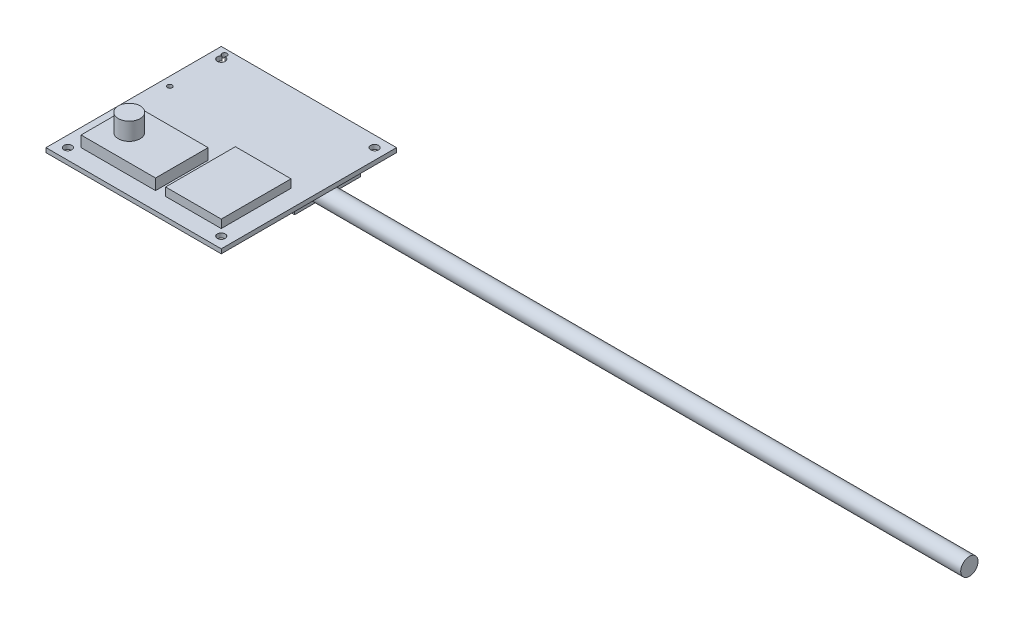
ISO-10303-21;
HEADER;
FILE_DESCRIPTION(('STEP AP214'),'2;1');
FILE_NAME('part.step','',(''),(''),'','','');
FILE_SCHEMA(('AUTOMOTIVE_DESIGN { 1 0 10303 214 1 1 1 1 }'));
ENDSEC;
DATA;
#1=APPLICATION_CONTEXT('core data for automotive mechanical design processes');
#2=APPLICATION_PROTOCOL_DEFINITION('international standard','automotive_design',2000,#1);
#3=PRODUCT_CONTEXT('',#1,'mechanical');
#4=PRODUCT('Part','Part','',(#3));
#5=PRODUCT_RELATED_PRODUCT_CATEGORY('part','',(#4));
#6=PRODUCT_DEFINITION_FORMATION('','',#4);
#7=PRODUCT_DEFINITION_CONTEXT('part definition',#1,'design');
#8=PRODUCT_DEFINITION('design','',#6,#7);
#9=PRODUCT_DEFINITION_SHAPE('','',#8);
#10=(LENGTH_UNIT() NAMED_UNIT(*) SI_UNIT(.MILLI.,.METRE.));
#11=(NAMED_UNIT(*) PLANE_ANGLE_UNIT() SI_UNIT($,.RADIAN.));
#12=(NAMED_UNIT(*) SI_UNIT($,.STERADIAN.) SOLID_ANGLE_UNIT());
#13=UNCERTAINTY_MEASURE_WITH_UNIT(LENGTH_MEASURE(1.E-05),#10,'distance_accuracy_value','');
#14=(GEOMETRIC_REPRESENTATION_CONTEXT(3) GLOBAL_UNCERTAINTY_ASSIGNED_CONTEXT((#13)) GLOBAL_UNIT_ASSIGNED_CONTEXT((#10,
#11,#12)) REPRESENTATION_CONTEXT('',''));
#15=CARTESIAN_POINT('',(0.,0.,0.));
#16=DIRECTION('',(0.,0.,1.));
#17=DIRECTION('',(1.,0.,0.));
#18=AXIS2_PLACEMENT_3D('',#15,#16,#17);
#19=CARTESIAN_POINT('',(0.,2.,0.));
#20=DIRECTION('',(0.,-1.,0.));
#21=DIRECTION('',(0.,0.,-1.));
#22=AXIS2_PLACEMENT_3D('',#19,#20,#21);
#23=PLANE('',#22);
#24=DIRECTION('',(0.,0.,1.));
#25=VECTOR('',#24,1.);
#26=CARTESIAN_POINT('',(7.99999999999999,2.,-32.));
#27=LINE('',#26,#25);
#28=CARTESIAN_POINT('',(7.99999999999999,2.,-32.));
#29=VERTEX_POINT('',#28);
#30=CARTESIAN_POINT('',(8.,2.,-8.));
#31=VERTEX_POINT('',#30);
#32=EDGE_CURVE('E189',#29,#31,#27,.T.);
#33=ORIENTED_EDGE('',*,*,#32,.F.);
#34=DIRECTION('',(-1.,0.,0.));
#35=VECTOR('',#34,1.);
#36=CARTESIAN_POINT('',(7.99999999999999,2.,-32.));
#37=LINE('',#36,#35);
#38=CARTESIAN_POINT('',(42.,2.,-32.));
#39=VERTEX_POINT('',#38);
#40=EDGE_CURVE('E195',#39,#29,#37,.T.);
#41=ORIENTED_EDGE('',*,*,#40,.F.);
#42=DIRECTION('',(0.,0.,-1.));
#43=VECTOR('',#42,1.);
#44=CARTESIAN_POINT('',(42.,2.,-32.));
#45=LINE('',#44,#43);
#46=CARTESIAN_POINT('',(42.,2.,-8.));
#47=VERTEX_POINT('',#46);
#48=EDGE_CURVE('E207',#47,#39,#45,.T.);
#49=ORIENTED_EDGE('',*,*,#48,.F.);
#50=DIRECTION('',(1.,0.,0.));
#51=VECTOR('',#50,1.);
#52=CARTESIAN_POINT('',(8.,2.,-8.));
#53=LINE('',#52,#51);
#54=EDGE_CURVE('E204',#31,#47,#53,.T.);
#55=ORIENTED_EDGE('',*,*,#54,.F.);
#56=EDGE_LOOP('',(#33,#41,#49,#55));
#57=FACE_BOUND('',#56,.T.);
#58=CARTESIAN_POINT('',(4.00000000000001,2.,-52.5));
#59=DIRECTION('',(0.,-1.,0.));
#60=DIRECTION('',(0.,0.,-1.));
#61=AXIS2_PLACEMENT_3D('',#58,#59,#60);
#62=CIRCLE('',#61,1.115);
#63=CARTESIAN_POINT('',(4.00000000000001,2.,-53.615));
#64=VERTEX_POINT('',#63);
#65=EDGE_CURVE('E223',#64,#64,#62,.T.);
#66=ORIENTED_EDGE('',*,*,#65,.T.);
#67=EDGE_LOOP('',(#66));
#68=FACE_BOUND('',#67,.T.);
#69=CARTESIAN_POINT('',(75.,2.,-75.));
#70=DIRECTION('',(0.,1.,0.));
#71=DIRECTION('',(0.,0.,1.));
#72=AXIS2_PLACEMENT_3D('',#69,#70,#71);
#73=CIRCLE('',#72,1.8);
#74=CARTESIAN_POINT('',(75.,2.,-73.2));
#75=VERTEX_POINT('',#74);
#76=EDGE_CURVE('E267',#75,#75,#73,.T.);
#77=ORIENTED_EDGE('',*,*,#76,.F.);
#78=EDGE_LOOP('',(#77));
#79=FACE_BOUND('',#78,.T.);
#80=CARTESIAN_POINT('',(5.,2.,-75.));
#81=DIRECTION('',(0.,1.,0.));
#82=DIRECTION('',(0.,0.,1.));
#83=AXIS2_PLACEMENT_3D('',#80,#81,#82);
#84=CIRCLE('',#83,1.8);
#85=CARTESIAN_POINT('',(3.86089167085515,2.,-76.3937116683421));
#86=VERTEX_POINT('',#85);
#87=CARTESIAN_POINT('',(4.86369108776554,2.,-76.7948314351062));
#88=VERTEX_POINT('',#87);
#89=EDGE_CURVE('E270',#86,#88,#84,.T.);
#90=ORIENTED_EDGE('',*,*,#89,.F.);
#91=CARTESIAN_POINT('',(4.,2.,-77.5));
#92=DIRECTION('',(0.,-1.,0.));
#93=DIRECTION('',(0.,0.,-1.));
#94=AXIS2_PLACEMENT_3D('',#91,#92,#93);
#95=CIRCLE('',#94,1.115);
#96=EDGE_CURVE('E227',#86,#88,#95,.T.);
#97=ORIENTED_EDGE('',*,*,#96,.T.);
#98=EDGE_LOOP('',(#90,#97));
#99=FACE_BOUND('',#98,.T.);
#100=DIRECTION('',(0.,0.,1.));
#101=VECTOR('',#100,1.);
#102=CARTESIAN_POINT('',(0.,2.,0.));
#103=LINE('',#102,#101);
#104=CARTESIAN_POINT('',(0.,2.,-80.));
#105=VERTEX_POINT('',#104);
#106=CARTESIAN_POINT('',(0.,2.,0.));
#107=VERTEX_POINT('',#106);
#108=EDGE_CURVE('E277',#105,#107,#103,.T.);
#109=ORIENTED_EDGE('',*,*,#108,.T.);
#110=DIRECTION('',(1.,0.,0.));
#111=VECTOR('',#110,1.);
#112=CARTESIAN_POINT('',(0.,2.,0.));
#113=LINE('',#112,#111);
#114=CARTESIAN_POINT('',(80.,2.,0.));
#115=VERTEX_POINT('',#114);
#116=EDGE_CURVE('E280',#107,#115,#113,.T.);
#117=ORIENTED_EDGE('',*,*,#116,.T.);
#118=DIRECTION('',(0.,0.,-1.));
#119=VECTOR('',#118,1.);
#120=CARTESIAN_POINT('',(80.,2.,0.));
#121=LINE('',#120,#119);
#122=CARTESIAN_POINT('',(80.,2.,-80.));
#123=VERTEX_POINT('',#122);
#124=EDGE_CURVE('E283',#115,#123,#121,.T.);
#125=ORIENTED_EDGE('',*,*,#124,.T.);
#126=DIRECTION('',(-1.,0.,0.));
#127=VECTOR('',#126,1.);
#128=CARTESIAN_POINT('',(0.,2.,-80.));
#129=LINE('',#128,#127);
#130=EDGE_CURVE('E285',#123,#105,#129,.T.);
#131=ORIENTED_EDGE('',*,*,#130,.T.);
#132=EDGE_LOOP('',(#109,#117,#125,#131));
#133=FACE_BOUND('',#132,.T.);
#134=CARTESIAN_POINT('',(5.,2.,-4.99999999999999));
#135=DIRECTION('',(0.,1.,0.));
#136=DIRECTION('',(0.,0.,1.));
#137=AXIS2_PLACEMENT_3D('',#134,#135,#136);
#138=CIRCLE('',#137,1.8);
#139=CARTESIAN_POINT('',(5.,2.,-3.19999999999999));
#140=VERTEX_POINT('',#139);
#141=EDGE_CURVE('E309',#140,#140,#138,.T.);
#142=ORIENTED_EDGE('',*,*,#141,.F.);
#143=EDGE_LOOP('',(#142));
#144=FACE_BOUND('',#143,.T.);
#145=CARTESIAN_POINT('',(75.,2.,-4.99999999999999));
#146=DIRECTION('',(0.,1.,0.));
#147=DIRECTION('',(0.,0.,1.));
#148=AXIS2_PLACEMENT_3D('',#145,#146,#147);
#149=CIRCLE('',#148,1.8);
#150=CARTESIAN_POINT('',(75.,2.,-3.19999999999999));
#151=VERTEX_POINT('',#150);
#152=EDGE_CURVE('E315',#151,#151,#149,.T.);
#153=ORIENTED_EDGE('',*,*,#152,.F.);
#154=EDGE_LOOP('',(#153));
#155=FACE_BOUND('',#154,.T.);
#156=DIRECTION('',(0.,0.,1.));
#157=VECTOR('',#156,1.);
#158=CARTESIAN_POINT('',(46.6,2.,-39.85));
#159=LINE('',#158,#157);
#160=CARTESIAN_POINT('',(46.6,2.,-39.85));
#161=VERTEX_POINT('',#160);
#162=CARTESIAN_POINT('',(46.6,2.,-8.));
#163=VERTEX_POINT('',#162);
#164=EDGE_CURVE('E178',#161,#163,#159,.T.);
#165=ORIENTED_EDGE('',*,*,#164,.F.);
#166=DIRECTION('',(-1.,0.,0.));
#167=VECTOR('',#166,1.);
#168=CARTESIAN_POINT('',(46.6,2.,-39.85));
#169=LINE('',#168,#167);
#170=CARTESIAN_POINT('',(72.,2.,-39.85));
#171=VERTEX_POINT('',#170);
#172=EDGE_CURVE('E175',#171,#161,#169,.T.);
#173=ORIENTED_EDGE('',*,*,#172,.F.);
#174=DIRECTION('',(0.,0.,-1.));
#175=VECTOR('',#174,1.);
#176=CARTESIAN_POINT('',(72.,2.,-39.85));
#177=LINE('',#176,#175);
#178=CARTESIAN_POINT('',(72.,2.,-8.));
#179=VERTEX_POINT('',#178);
#180=EDGE_CURVE('E53',#179,#171,#177,.T.);
#181=ORIENTED_EDGE('',*,*,#180,.F.);
#182=DIRECTION('',(1.,0.,0.));
#183=VECTOR('',#182,1.);
#184=CARTESIAN_POINT('',(46.6,2.,-8.));
#185=LINE('',#184,#183);
#186=EDGE_CURVE('E48',#163,#179,#185,.T.);
#187=ORIENTED_EDGE('',*,*,#186,.F.);
#188=EDGE_LOOP('',(#165,#173,#181,#187));
#189=FACE_BOUND('',#188,.T.);
#190=ADVANCED_FACE('F33',(#57,#68,#79,#99,#133,#144,#155,#189),#23,.F.);
#191=CARTESIAN_POINT('',(0.,2.,0.));
#192=DIRECTION('',(1.,0.,0.));
#193=DIRECTION('',(0.,0.,-1.));
#194=AXIS2_PLACEMENT_3D('',#191,#192,#193);
#195=PLANE('',#194);
#196=DIRECTION('',(0.,0.,1.));
#197=VECTOR('',#196,1.);
#198=CARTESIAN_POINT('',(0.,0.,0.));
#199=LINE('',#198,#197);
#200=CARTESIAN_POINT('',(0.,0.,-80.));
#201=VERTEX_POINT('',#200);
#202=CARTESIAN_POINT('',(0.,0.,0.));
#203=VERTEX_POINT('',#202);
#204=EDGE_CURVE('E274',#201,#203,#199,.T.);
#205=ORIENTED_EDGE('',*,*,#204,.T.);
#206=DIRECTION('',(0.,-1.,0.));
#207=VECTOR('',#206,1.);
#208=CARTESIAN_POINT('',(0.,2.,0.));
#209=LINE('',#208,#207);
#210=EDGE_CURVE('E303',#107,#203,#209,.T.);
#211=ORIENTED_EDGE('',*,*,#210,.F.);
#212=ORIENTED_EDGE('',*,*,#108,.F.);
#213=DIRECTION('',(0.,-1.,0.));
#214=VECTOR('',#213,1.);
#215=CARTESIAN_POINT('',(0.,2.,-80.));
#216=LINE('',#215,#214);
#217=EDGE_CURVE('E287',#105,#201,#216,.T.);
#218=ORIENTED_EDGE('',*,*,#217,.T.);
#219=EDGE_LOOP('',(#205,#211,#212,#218));
#220=FACE_BOUND('',#219,.T.);
#221=ADVANCED_FACE('F355',(#220),#195,.F.);
#222=CARTESIAN_POINT('',(0.,2.,0.));
#223=DIRECTION('',(0.,0.,-1.));
#224=DIRECTION('',(-1.,0.,0.));
#225=AXIS2_PLACEMENT_3D('',#222,#223,#224);
#226=PLANE('',#225);
#227=DIRECTION('',(1.,0.,0.));
#228=VECTOR('',#227,1.);
#229=CARTESIAN_POINT('',(0.,0.,0.));
#230=LINE('',#229,#228);
#231=CARTESIAN_POINT('',(80.,0.,0.));
#232=VERTEX_POINT('',#231);
#233=EDGE_CURVE('E290',#203,#232,#230,.T.);
#234=ORIENTED_EDGE('',*,*,#233,.T.);
#235=DIRECTION('',(0.,-1.,0.));
#236=VECTOR('',#235,1.);
#237=CARTESIAN_POINT('',(80.,2.,0.));
#238=LINE('',#237,#236);
#239=EDGE_CURVE('E300',#115,#232,#238,.T.);
#240=ORIENTED_EDGE('',*,*,#239,.F.);
#241=ORIENTED_EDGE('',*,*,#116,.F.);
#242=ORIENTED_EDGE('',*,*,#210,.T.);
#243=EDGE_LOOP('',(#234,#240,#241,#242));
#244=FACE_BOUND('',#243,.T.);
#245=ADVANCED_FACE('F465',(#244),#226,.F.);
#246=CARTESIAN_POINT('',(80.,2.,0.));
#247=DIRECTION('',(-1.,0.,0.));
#248=DIRECTION('',(0.,0.,1.));
#249=AXIS2_PLACEMENT_3D('',#246,#247,#248);
#250=PLANE('',#249);
#251=DIRECTION('',(0.,0.,-1.));
#252=VECTOR('',#251,1.);
#253=CARTESIAN_POINT('',(80.,0.,0.));
#254=LINE('',#253,#252);
#255=CARTESIAN_POINT('',(80.,0.,-80.));
#256=VERTEX_POINT('',#255);
#257=EDGE_CURVE('E292',#232,#256,#254,.T.);
#258=ORIENTED_EDGE('',*,*,#257,.T.);
#259=DIRECTION('',(0.,-1.,0.));
#260=VECTOR('',#259,1.);
#261=CARTESIAN_POINT('',(80.,2.,-80.));
#262=LINE('',#261,#260);
#263=EDGE_CURVE('E297',#123,#256,#262,.T.);
#264=ORIENTED_EDGE('',*,*,#263,.F.);
#265=ORIENTED_EDGE('',*,*,#124,.F.);
#266=ORIENTED_EDGE('',*,*,#239,.T.);
#267=EDGE_LOOP('',(#258,#264,#265,#266));
#268=FACE_BOUND('',#267,.T.);
#269=ADVANCED_FACE('F461',(#268),#250,.F.);
#270=CARTESIAN_POINT('',(0.,2.,-80.));
#271=DIRECTION('',(0.,0.,1.));
#272=DIRECTION('',(1.,0.,0.));
#273=AXIS2_PLACEMENT_3D('',#270,#271,#272);
#274=PLANE('',#273);
#275=DIRECTION('',(-1.,0.,0.));
#276=VECTOR('',#275,1.);
#277=CARTESIAN_POINT('',(0.,0.,-80.));
#278=LINE('',#277,#276);
#279=EDGE_CURVE('E281',#256,#201,#278,.T.);
#280=ORIENTED_EDGE('',*,*,#279,.T.);
#281=ORIENTED_EDGE('',*,*,#217,.F.);
#282=ORIENTED_EDGE('',*,*,#130,.F.);
#283=ORIENTED_EDGE('',*,*,#263,.T.);
#284=EDGE_LOOP('',(#280,#281,#282,#283));
#285=FACE_BOUND('',#284,.T.);
#286=ADVANCED_FACE('F332',(#285),#274,.F.);
#287=CARTESIAN_POINT('',(0.,0.,0.));
#288=DIRECTION('',(0.,-1.,0.));
#289=DIRECTION('',(0.,0.,-1.));
#290=AXIS2_PLACEMENT_3D('',#287,#288,#289);
#291=PLANE('',#290);
#292=CARTESIAN_POINT('',(4.00000000000001,0.,-52.5));
#293=DIRECTION('',(0.,-1.,0.));
#294=DIRECTION('',(0.,0.,-1.));
#295=AXIS2_PLACEMENT_3D('',#292,#293,#294);
#296=CIRCLE('',#295,1.115);
#297=CARTESIAN_POINT('',(4.00000000000001,0.,-53.615));
#298=VERTEX_POINT('',#297);
#299=EDGE_CURVE('E226',#298,#298,#296,.T.);
#300=ORIENTED_EDGE('',*,*,#299,.F.);
#301=EDGE_LOOP('',(#300));
#302=FACE_BOUND('',#301,.T.);
#303=CARTESIAN_POINT('',(4.,0.,-77.5));
#304=DIRECTION('',(0.,-1.,0.));
#305=DIRECTION('',(0.,0.,-1.));
#306=AXIS2_PLACEMENT_3D('',#303,#304,#305);
#307=CIRCLE('',#306,1.115);
#308=CARTESIAN_POINT('',(3.86089167085515,0.,-76.3937116683421));
#309=VERTEX_POINT('',#308);
#310=CARTESIAN_POINT('',(4.86369108776555,0.,-76.7948314351062));
#311=VERTEX_POINT('',#310);
#312=EDGE_CURVE('E230',#309,#311,#307,.T.);
#313=ORIENTED_EDGE('',*,*,#312,.F.);
#314=CARTESIAN_POINT('',(5.,0.,-75.));
#315=DIRECTION('',(0.,1.,0.));
#316=DIRECTION('',(0.,0.,1.));
#317=AXIS2_PLACEMENT_3D('',#314,#315,#316);
#318=CIRCLE('',#317,1.8);
#319=EDGE_CURVE('E271',#309,#311,#318,.T.);
#320=ORIENTED_EDGE('',*,*,#319,.T.);
#321=EDGE_LOOP('',(#313,#320));
#322=FACE_BOUND('',#321,.T.);
#323=DIRECTION('',(0.,0.,1.));
#324=VECTOR('',#323,1.);
#325=CARTESIAN_POINT('',(11.5,0.,-75.));
#326=LINE('',#325,#324);
#327=CARTESIAN_POINT('',(11.5,0.,-75.));
#328=VERTEX_POINT('',#327);
#329=CARTESIAN_POINT('',(11.5,0.,-45.));
#330=VERTEX_POINT('',#329);
#331=EDGE_CURVE('E232',#328,#330,#326,.T.);
#332=ORIENTED_EDGE('',*,*,#331,.T.);
#333=DIRECTION('',(1.,0.,0.));
#334=VECTOR('',#333,1.);
#335=CARTESIAN_POINT('',(11.5,0.,-45.));
#336=LINE('',#335,#334);
#337=CARTESIAN_POINT('',(68.5,0.,-45.));
#338=VERTEX_POINT('',#337);
#339=EDGE_CURVE('E248',#330,#338,#336,.T.);
#340=ORIENTED_EDGE('',*,*,#339,.T.);
#341=DIRECTION('',(0.,0.,-1.));
#342=VECTOR('',#341,1.);
#343=CARTESIAN_POINT('',(68.5,0.,-75.));
#344=LINE('',#343,#342);
#345=CARTESIAN_POINT('',(68.5,0.,-75.));
#346=VERTEX_POINT('',#345);
#347=EDGE_CURVE('E250',#338,#346,#344,.T.);
#348=ORIENTED_EDGE('',*,*,#347,.T.);
#349=DIRECTION('',(-1.,0.,0.));
#350=VECTOR('',#349,1.);
#351=CARTESIAN_POINT('',(11.5,0.,-75.));
#352=LINE('',#351,#350);
#353=EDGE_CURVE('E237',#346,#328,#352,.T.);
#354=ORIENTED_EDGE('',*,*,#353,.T.);
#355=EDGE_LOOP('',(#332,#340,#348,#354));
#356=FACE_BOUND('',#355,.T.);
#357=CARTESIAN_POINT('',(75.,0.,-75.));
#358=DIRECTION('',(0.,1.,0.));
#359=DIRECTION('',(0.,0.,1.));
#360=AXIS2_PLACEMENT_3D('',#357,#358,#359);
#361=CIRCLE('',#360,1.8);
#362=CARTESIAN_POINT('',(75.,0.,-73.2));
#363=VERTEX_POINT('',#362);
#364=EDGE_CURVE('E256',#363,#363,#361,.T.);
#365=ORIENTED_EDGE('',*,*,#364,.T.);
#366=EDGE_LOOP('',(#365));
#367=FACE_BOUND('',#366,.T.);
#368=ORIENTED_EDGE('',*,*,#204,.F.);
#369=ORIENTED_EDGE('',*,*,#279,.F.);
#370=ORIENTED_EDGE('',*,*,#257,.F.);
#371=ORIENTED_EDGE('',*,*,#233,.F.);
#372=EDGE_LOOP('',(#368,#369,#370,#371));
#373=FACE_BOUND('',#372,.T.);
#374=CARTESIAN_POINT('',(5.,0.,-4.99999999999999));
#375=DIRECTION('',(0.,1.,0.));
#376=DIRECTION('',(0.,0.,1.));
#377=AXIS2_PLACEMENT_3D('',#374,#375,#376);
#378=CIRCLE('',#377,1.8);
#379=CARTESIAN_POINT('',(5.,0.,-3.19999999999999));
#380=VERTEX_POINT('',#379);
#381=EDGE_CURVE('E306',#380,#380,#378,.T.);
#382=ORIENTED_EDGE('',*,*,#381,.T.);
#383=EDGE_LOOP('',(#382));
#384=FACE_BOUND('',#383,.T.);
#385=CARTESIAN_POINT('',(75.,0.,-4.99999999999999));
#386=DIRECTION('',(0.,1.,0.));
#387=DIRECTION('',(0.,0.,1.));
#388=AXIS2_PLACEMENT_3D('',#385,#386,#387);
#389=CIRCLE('',#388,1.8);
#390=CARTESIAN_POINT('',(75.,0.,-3.19999999999999));
#391=VERTEX_POINT('',#390);
#392=EDGE_CURVE('E312',#391,#391,#389,.T.);
#393=ORIENTED_EDGE('',*,*,#392,.T.);
#394=EDGE_LOOP('',(#393));
#395=FACE_BOUND('',#394,.T.);
#396=ADVANCED_FACE('F328',(#302,#322,#356,#367,#373,#384,#395),#291,.T.);
#397=CARTESIAN_POINT('',(5.,0.,-75.));
#398=DIRECTION('',(0.,1.,0.));
#399=DIRECTION('',(0.,0.,1.));
#400=AXIS2_PLACEMENT_3D('',#397,#398,#399);
#401=CYLINDRICAL_SURFACE('',#400,1.8);
#402=ORIENTED_EDGE('',*,*,#319,.F.);
#403=DIRECTION('',(0.,-1.,0.));
#404=VECTOR('',#403,1.);
#405=CARTESIAN_POINT('',(3.86089167085515,-5.4,-76.3937116683421));
#406=LINE('',#405,#404);
#407=EDGE_CURVE('E41',#309,#86,#406,.F.);
#408=ORIENTED_EDGE('',*,*,#407,.T.);
#409=ORIENTED_EDGE('',*,*,#89,.T.);
#410=DIRECTION('',(0.,-1.,0.));
#411=VECTOR('',#410,1.);
#412=CARTESIAN_POINT('',(4.86369108776554,-5.4,-76.7948314351062));
#413=LINE('',#412,#411);
#414=EDGE_CURVE('E318',#88,#311,#413,.T.);
#415=ORIENTED_EDGE('',*,*,#414,.T.);
#416=EDGE_LOOP('',(#402,#408,#409,#415));
#417=FACE_BOUND('',#416,.T.);
#418=ADVANCED_FACE('F331',(#417),#401,.F.);
#419=CARTESIAN_POINT('',(75.,0.,-75.));
#420=DIRECTION('',(0.,1.,0.));
#421=DIRECTION('',(0.,0.,1.));
#422=AXIS2_PLACEMENT_3D('',#419,#420,#421);
#423=CYLINDRICAL_SURFACE('',#422,1.8);
#424=ORIENTED_EDGE('',*,*,#364,.F.);
#425=EDGE_LOOP('',(#424));
#426=FACE_BOUND('',#425,.T.);
#427=ORIENTED_EDGE('',*,*,#76,.T.);
#428=EDGE_LOOP('',(#427));
#429=FACE_BOUND('',#428,.T.);
#430=ADVANCED_FACE('F452',(#426,#429),#423,.F.);
#431=CARTESIAN_POINT('',(5.,0.,-4.99999999999999));
#432=DIRECTION('',(0.,1.,0.));
#433=DIRECTION('',(0.,0.,1.));
#434=AXIS2_PLACEMENT_3D('',#431,#432,#433);
#435=CYLINDRICAL_SURFACE('',#434,1.8);
#436=ORIENTED_EDGE('',*,*,#381,.F.);
#437=EDGE_LOOP('',(#436));
#438=FACE_BOUND('',#437,.T.);
#439=ORIENTED_EDGE('',*,*,#141,.T.);
#440=EDGE_LOOP('',(#439));
#441=FACE_BOUND('',#440,.T.);
#442=ADVANCED_FACE('F351',(#438,#441),#435,.F.);
#443=CARTESIAN_POINT('',(75.,0.,-4.99999999999999));
#444=DIRECTION('',(0.,1.,0.));
#445=DIRECTION('',(0.,0.,1.));
#446=AXIS2_PLACEMENT_3D('',#443,#444,#445);
#447=CYLINDRICAL_SURFACE('',#446,1.8);
#448=ORIENTED_EDGE('',*,*,#392,.F.);
#449=EDGE_LOOP('',(#448));
#450=FACE_BOUND('',#449,.T.);
#451=ORIENTED_EDGE('',*,*,#152,.T.);
#452=EDGE_LOOP('',(#451));
#453=FACE_BOUND('',#452,.T.);
#454=ADVANCED_FACE('F35',(#450,#453),#447,.F.);
#455=CARTESIAN_POINT('',(11.5,-12.8,-75.));
#456=DIRECTION('',(-1.,0.,0.));
#457=DIRECTION('',(0.,0.,1.));
#458=AXIS2_PLACEMENT_3D('',#455,#456,#457);
#459=PLANE('',#458);
#460=ORIENTED_EDGE('',*,*,#331,.F.);
#461=DIRECTION('',(0.,1.,0.));
#462=VECTOR('',#461,1.);
#463=CARTESIAN_POINT('',(11.5,-12.8,-75.));
#464=LINE('',#463,#462);
#465=CARTESIAN_POINT('',(11.5,-12.8,-75.));
#466=VERTEX_POINT('',#465);
#467=EDGE_CURVE('E253',#466,#328,#464,.T.);
#468=ORIENTED_EDGE('',*,*,#467,.F.);
#469=DIRECTION('',(0.,0.,1.));
#470=VECTOR('',#469,1.);
#471=CARTESIAN_POINT('',(11.5,-12.8,-75.));
#472=LINE('',#471,#470);
#473=CARTESIAN_POINT('',(11.5,-12.8,-45.));
#474=VERTEX_POINT('',#473);
#475=EDGE_CURVE('E233',#466,#474,#472,.T.);
#476=ORIENTED_EDGE('',*,*,#475,.T.);
#477=DIRECTION('',(0.,1.,0.));
#478=VECTOR('',#477,1.);
#479=CARTESIAN_POINT('',(11.5,-12.8,-45.));
#480=LINE('',#479,#478);
#481=EDGE_CURVE('E246',#474,#330,#480,.T.);
#482=ORIENTED_EDGE('',*,*,#481,.T.);
#483=EDGE_LOOP('',(#460,#468,#476,#482));
#484=FACE_BOUND('',#483,.T.);
#485=ADVANCED_FACE('F350',(#484),#459,.T.);
#486=CARTESIAN_POINT('',(11.5,-12.8,-75.));
#487=DIRECTION('',(0.,0.,-1.));
#488=DIRECTION('',(-1.,0.,0.));
#489=AXIS2_PLACEMENT_3D('',#486,#487,#488);
#490=PLANE('',#489);
#491=ORIENTED_EDGE('',*,*,#353,.F.);
#492=DIRECTION('',(0.,1.,0.));
#493=VECTOR('',#492,1.);
#494=CARTESIAN_POINT('',(68.5,-12.8,-75.));
#495=LINE('',#494,#493);
#496=CARTESIAN_POINT('',(68.5,-12.8,-75.));
#497=VERTEX_POINT('',#496);
#498=EDGE_CURVE('E257',#497,#346,#495,.T.);
#499=ORIENTED_EDGE('',*,*,#498,.F.);
#500=DIRECTION('',(-1.,0.,0.));
#501=VECTOR('',#500,1.);
#502=CARTESIAN_POINT('',(11.5,-12.8,-75.));
#503=LINE('',#502,#501);
#504=EDGE_CURVE('E243',#497,#466,#503,.T.);
#505=ORIENTED_EDGE('',*,*,#504,.T.);
#506=ORIENTED_EDGE('',*,*,#467,.T.);
#507=EDGE_LOOP('',(#491,#499,#505,#506));
#508=FACE_BOUND('',#507,.T.);
#509=ADVANCED_FACE('F438',(#508),#490,.T.);
#510=CARTESIAN_POINT('',(68.5,-12.8,-75.));
#511=DIRECTION('',(1.,0.,0.));
#512=DIRECTION('',(0.,0.,-1.));
#513=AXIS2_PLACEMENT_3D('',#510,#511,#512);
#514=PLANE('',#513);
#515=CARTESIAN_POINT('',(68.5,-5.8,-53.));
#516=DIRECTION('',(1.,0.,0.));
#517=DIRECTION('',(0.,0.,-1.));
#518=AXIS2_PLACEMENT_3D('',#515,#516,#517);
#519=CIRCLE('',#518,3.95);
#520=CARTESIAN_POINT('',(68.5,-5.8,-56.95));
#521=VERTEX_POINT('',#520);
#522=EDGE_CURVE('E11',#521,#521,#519,.T.);
#523=ORIENTED_EDGE('',*,*,#522,.F.);
#524=EDGE_LOOP('',(#523));
#525=FACE_BOUND('',#524,.T.);
#526=ORIENTED_EDGE('',*,*,#347,.F.);
#527=DIRECTION('',(0.,1.,0.));
#528=VECTOR('',#527,1.);
#529=CARTESIAN_POINT('',(68.5,-12.8,-45.));
#530=LINE('',#529,#528);
#531=CARTESIAN_POINT('',(68.5,-12.8,-45.));
#532=VERTEX_POINT('',#531);
#533=EDGE_CURVE('E260',#532,#338,#530,.T.);
#534=ORIENTED_EDGE('',*,*,#533,.F.);
#535=DIRECTION('',(0.,0.,-1.));
#536=VECTOR('',#535,1.);
#537=CARTESIAN_POINT('',(68.5,-12.8,-75.));
#538=LINE('',#537,#536);
#539=EDGE_CURVE('E240',#532,#497,#538,.T.);
#540=ORIENTED_EDGE('',*,*,#539,.T.);
#541=ORIENTED_EDGE('',*,*,#498,.T.);
#542=EDGE_LOOP('',(#526,#534,#540,#541));
#543=FACE_BOUND('',#542,.T.);
#544=ADVANCED_FACE('F441',(#525,#543),#514,.T.);
#545=CARTESIAN_POINT('',(11.5,-12.8,-45.));
#546=DIRECTION('',(0.,0.,1.));
#547=DIRECTION('',(1.,0.,0.));
#548=AXIS2_PLACEMENT_3D('',#545,#546,#547);
#549=PLANE('',#548);
#550=ORIENTED_EDGE('',*,*,#339,.F.);
#551=ORIENTED_EDGE('',*,*,#481,.F.);
#552=DIRECTION('',(1.,0.,0.));
#553=VECTOR('',#552,1.);
#554=CARTESIAN_POINT('',(11.5,-12.8,-45.));
#555=LINE('',#554,#553);
#556=EDGE_CURVE('E236',#474,#532,#555,.T.);
#557=ORIENTED_EDGE('',*,*,#556,.T.);
#558=ORIENTED_EDGE('',*,*,#533,.T.);
#559=EDGE_LOOP('',(#550,#551,#557,#558));
#560=FACE_BOUND('',#559,.T.);
#561=ADVANCED_FACE('F436',(#560),#549,.T.);
#562=CARTESIAN_POINT('',(0.,-12.8,0.));
#563=DIRECTION('',(0.,1.,0.));
#564=DIRECTION('',(0.,0.,1.));
#565=AXIS2_PLACEMENT_3D('',#562,#563,#564);
#566=PLANE('',#565);
#567=ORIENTED_EDGE('',*,*,#475,.F.);
#568=ORIENTED_EDGE('',*,*,#504,.F.);
#569=ORIENTED_EDGE('',*,*,#539,.F.);
#570=ORIENTED_EDGE('',*,*,#556,.F.);
#571=EDGE_LOOP('',(#567,#568,#569,#570));
#572=FACE_BOUND('',#571,.T.);
#573=ADVANCED_FACE('F432',(#572),#566,.F.);
#574=CARTESIAN_POINT('',(4.,2.,-77.5));
#575=DIRECTION('',(0.,-1.,0.));
#576=DIRECTION('',(0.,0.,-1.));
#577=AXIS2_PLACEMENT_3D('',#574,#575,#576);
#578=CYLINDRICAL_SURFACE('',#577,1.115);
#579=ORIENTED_EDGE('',*,*,#312,.T.);
#580=ORIENTED_EDGE('',*,*,#414,.F.);
#581=ORIENTED_EDGE('',*,*,#96,.F.);
#582=ORIENTED_EDGE('',*,*,#407,.F.);
#583=EDGE_LOOP('',(#579,#580,#581,#582));
#584=FACE_BOUND('',#583,.T.);
#585=ADVANCED_FACE('F429',(#584),#578,.F.);
#586=CARTESIAN_POINT('',(4.00000000000001,2.,-52.5));
#587=DIRECTION('',(0.,-1.,0.));
#588=DIRECTION('',(0.,0.,-1.));
#589=AXIS2_PLACEMENT_3D('',#586,#587,#588);
#590=CYLINDRICAL_SURFACE('',#589,1.115);
#591=ORIENTED_EDGE('',*,*,#299,.T.);
#592=EDGE_LOOP('',(#591));
#593=FACE_BOUND('',#592,.T.);
#594=ORIENTED_EDGE('',*,*,#65,.F.);
#595=EDGE_LOOP('',(#594));
#596=FACE_BOUND('',#595,.T.);
#597=ADVANCED_FACE('F325',(#593,#596),#590,.F.);
#598=CARTESIAN_POINT('',(7.99999999999999,7.,-32.));
#599=DIRECTION('',(1.,0.,0.));
#600=DIRECTION('',(0.,0.,-1.));
#601=AXIS2_PLACEMENT_3D('',#598,#599,#600);
#602=PLANE('',#601);
#603=ORIENTED_EDGE('',*,*,#32,.T.);
#604=DIRECTION('',(0.,-1.,0.));
#605=VECTOR('',#604,1.);
#606=CARTESIAN_POINT('',(8.,7.,-8.));
#607=LINE('',#606,#605);
#608=CARTESIAN_POINT('',(8.,7.,-8.));
#609=VERTEX_POINT('',#608);
#610=EDGE_CURVE('E220',#609,#31,#607,.T.);
#611=ORIENTED_EDGE('',*,*,#610,.F.);
#612=DIRECTION('',(0.,0.,1.));
#613=VECTOR('',#612,1.);
#614=CARTESIAN_POINT('',(7.99999999999999,7.,-32.));
#615=LINE('',#614,#613);
#616=CARTESIAN_POINT('',(7.99999999999999,7.,-32.));
#617=VERTEX_POINT('',#616);
#618=EDGE_CURVE('E191',#617,#609,#615,.T.);
#619=ORIENTED_EDGE('',*,*,#618,.F.);
#620=DIRECTION('',(0.,-1.,0.));
#621=VECTOR('',#620,1.);
#622=CARTESIAN_POINT('',(7.99999999999999,7.,-32.));
#623=LINE('',#622,#621);
#624=EDGE_CURVE('E201',#617,#29,#623,.T.);
#625=ORIENTED_EDGE('',*,*,#624,.T.);
#626=EDGE_LOOP('',(#603,#611,#619,#625));
#627=FACE_BOUND('',#626,.T.);
#628=ADVANCED_FACE('F422',(#627),#602,.F.);
#629=CARTESIAN_POINT('',(8.,7.,-8.));
#630=DIRECTION('',(0.,0.,-1.));
#631=DIRECTION('',(-1.,0.,0.));
#632=AXIS2_PLACEMENT_3D('',#629,#630,#631);
#633=PLANE('',#632);
#634=ORIENTED_EDGE('',*,*,#54,.T.);
#635=DIRECTION('',(0.,-1.,0.));
#636=VECTOR('',#635,1.);
#637=CARTESIAN_POINT('',(42.,7.,-8.));
#638=LINE('',#637,#636);
#639=CARTESIAN_POINT('',(42.,7.,-8.));
#640=VERTEX_POINT('',#639);
#641=EDGE_CURVE('E217',#640,#47,#638,.T.);
#642=ORIENTED_EDGE('',*,*,#641,.F.);
#643=DIRECTION('',(1.,0.,0.));
#644=VECTOR('',#643,1.);
#645=CARTESIAN_POINT('',(8.,7.,-8.));
#646=LINE('',#645,#644);
#647=EDGE_CURVE('E194',#609,#640,#646,.T.);
#648=ORIENTED_EDGE('',*,*,#647,.F.);
#649=ORIENTED_EDGE('',*,*,#610,.T.);
#650=EDGE_LOOP('',(#634,#642,#648,#649));
#651=FACE_BOUND('',#650,.T.);
#652=ADVANCED_FACE('F418',(#651),#633,.F.);
#653=CARTESIAN_POINT('',(42.,7.,-32.));
#654=DIRECTION('',(-1.,0.,0.));
#655=DIRECTION('',(0.,0.,1.));
#656=AXIS2_PLACEMENT_3D('',#653,#654,#655);
#657=PLANE('',#656);
#658=ORIENTED_EDGE('',*,*,#48,.T.);
#659=DIRECTION('',(0.,-1.,0.));
#660=VECTOR('',#659,1.);
#661=CARTESIAN_POINT('',(42.,7.,-32.));
#662=LINE('',#661,#660);
#663=CARTESIAN_POINT('',(42.,7.,-32.));
#664=VERTEX_POINT('',#663);
#665=EDGE_CURVE('E214',#664,#39,#662,.T.);
#666=ORIENTED_EDGE('',*,*,#665,.F.);
#667=DIRECTION('',(0.,0.,-1.));
#668=VECTOR('',#667,1.);
#669=CARTESIAN_POINT('',(42.,7.,-32.));
#670=LINE('',#669,#668);
#671=EDGE_CURVE('E197',#640,#664,#670,.T.);
#672=ORIENTED_EDGE('',*,*,#671,.F.);
#673=ORIENTED_EDGE('',*,*,#641,.T.);
#674=EDGE_LOOP('',(#658,#666,#672,#673));
#675=FACE_BOUND('',#674,.T.);
#676=ADVANCED_FACE('F414',(#675),#657,.F.);
#677=CARTESIAN_POINT('',(7.99999999999999,7.,-32.));
#678=DIRECTION('',(0.,0.,1.));
#679=DIRECTION('',(1.,0.,0.));
#680=AXIS2_PLACEMENT_3D('',#677,#678,#679);
#681=PLANE('',#680);
#682=ORIENTED_EDGE('',*,*,#40,.T.);
#683=ORIENTED_EDGE('',*,*,#624,.F.);
#684=DIRECTION('',(-1.,0.,0.));
#685=VECTOR('',#684,1.);
#686=CARTESIAN_POINT('',(7.99999999999999,7.,-32.));
#687=LINE('',#686,#685);
#688=EDGE_CURVE('E199',#664,#617,#687,.T.);
#689=ORIENTED_EDGE('',*,*,#688,.F.);
#690=ORIENTED_EDGE('',*,*,#665,.T.);
#691=EDGE_LOOP('',(#682,#683,#689,#690));
#692=FACE_BOUND('',#691,.T.);
#693=ADVANCED_FACE('F410',(#692),#681,.F.);
#694=CARTESIAN_POINT('',(0.,7.,0.));
#695=DIRECTION('',(0.,1.,0.));
#696=DIRECTION('',(0.,0.,1.));
#697=AXIS2_PLACEMENT_3D('',#694,#695,#696);
#698=PLANE('',#697);
#699=CARTESIAN_POINT('',(18.,7.,-20.));
#700=DIRECTION('',(0.,1.,0.));
#701=DIRECTION('',(0.,0.,1.));
#702=AXIS2_PLACEMENT_3D('',#699,#700,#701);
#703=CIRCLE('',#702,5.);
#704=CARTESIAN_POINT('',(18.,7.,-15.));
#705=VERTEX_POINT('',#704);
#706=EDGE_CURVE('E179',#705,#705,#703,.T.);
#707=ORIENTED_EDGE('',*,*,#706,.F.);
#708=EDGE_LOOP('',(#707));
#709=FACE_BOUND('',#708,.T.);
#710=ORIENTED_EDGE('',*,*,#618,.T.);
#711=ORIENTED_EDGE('',*,*,#647,.T.);
#712=ORIENTED_EDGE('',*,*,#671,.T.);
#713=ORIENTED_EDGE('',*,*,#688,.T.);
#714=EDGE_LOOP('',(#710,#711,#712,#713));
#715=FACE_BOUND('',#714,.T.);
#716=ADVANCED_FACE('F406',(#709,#715),#698,.T.);
#717=CARTESIAN_POINT('',(18.,15.,-20.));
#718=DIRECTION('',(0.,-1.,0.));
#719=DIRECTION('',(0.,0.,-1.));
#720=AXIS2_PLACEMENT_3D('',#717,#718,#719);
#721=CYLINDRICAL_SURFACE('',#720,5.);
#722=CARTESIAN_POINT('',(18.,15.,-20.));
#723=DIRECTION('',(0.,1.,0.));
#724=DIRECTION('',(0.,0.,1.));
#725=AXIS2_PLACEMENT_3D('',#722,#723,#724);
#726=CIRCLE('',#725,5.);
#727=CARTESIAN_POINT('',(18.,15.,-15.));
#728=VERTEX_POINT('',#727);
#729=EDGE_CURVE('E182',#728,#728,#726,.T.);
#730=ORIENTED_EDGE('',*,*,#729,.F.);
#731=EDGE_LOOP('',(#730));
#732=FACE_BOUND('',#731,.T.);
#733=ORIENTED_EDGE('',*,*,#706,.T.);
#734=EDGE_LOOP('',(#733));
#735=FACE_BOUND('',#734,.T.);
#736=ADVANCED_FACE('F402',(#732,#735),#721,.T.);
#737=CARTESIAN_POINT('',(18.,15.,-20.));
#738=DIRECTION('',(0.,1.,0.));
#739=DIRECTION('',(0.,0.,1.));
#740=AXIS2_PLACEMENT_3D('',#737,#738,#739);
#741=PLANE('',#740);
#742=ORIENTED_EDGE('',*,*,#729,.T.);
#743=EDGE_LOOP('',(#742));
#744=FACE_BOUND('',#743,.T.);
#745=ADVANCED_FACE('F399',(#744),#741,.T.);
#746=CARTESIAN_POINT('',(46.6,5.75,-39.85));
#747=DIRECTION('',(1.,0.,0.));
#748=DIRECTION('',(0.,0.,-1.));
#749=AXIS2_PLACEMENT_3D('',#746,#747,#748);
#750=PLANE('',#749);
#751=ORIENTED_EDGE('',*,*,#164,.T.);
#752=DIRECTION('',(0.,-1.,0.));
#753=VECTOR('',#752,1.);
#754=CARTESIAN_POINT('',(46.6,5.75,-8.));
#755=LINE('',#754,#753);
#756=CARTESIAN_POINT('',(46.6,5.75,-8.));
#757=VERTEX_POINT('',#756);
#758=EDGE_CURVE('E159',#757,#163,#755,.T.);
#759=ORIENTED_EDGE('',*,*,#758,.F.);
#760=DIRECTION('',(0.,0.,1.));
#761=VECTOR('',#760,1.);
#762=CARTESIAN_POINT('',(46.6,5.75,-39.85));
#763=LINE('',#762,#761);
#764=CARTESIAN_POINT('',(46.6,5.75,-39.85));
#765=VERTEX_POINT('',#764);
#766=EDGE_CURVE('E166',#765,#757,#763,.T.);
#767=ORIENTED_EDGE('',*,*,#766,.F.);
#768=DIRECTION('',(0.,-1.,0.));
#769=VECTOR('',#768,1.);
#770=CARTESIAN_POINT('',(46.6,5.75,-39.85));
#771=LINE('',#770,#769);
#772=EDGE_CURVE('E364',#765,#161,#771,.T.);
#773=ORIENTED_EDGE('',*,*,#772,.T.);
#774=EDGE_LOOP('',(#751,#759,#767,#773));
#775=FACE_BOUND('',#774,.T.);
#776=ADVANCED_FACE('F177',(#775),#750,.F.);
#777=CARTESIAN_POINT('',(46.6,5.75,-8.));
#778=DIRECTION('',(0.,0.,-1.));
#779=DIRECTION('',(-1.,0.,0.));
#780=AXIS2_PLACEMENT_3D('',#777,#778,#779);
#781=PLANE('',#780);
#782=ORIENTED_EDGE('',*,*,#186,.T.);
#783=DIRECTION('',(0.,-1.,0.));
#784=VECTOR('',#783,1.);
#785=CARTESIAN_POINT('',(72.,5.75,-8.));
#786=LINE('',#785,#784);
#787=CARTESIAN_POINT('',(72.,5.75,-8.));
#788=VERTEX_POINT('',#787);
#789=EDGE_CURVE('E162',#788,#179,#786,.T.);
#790=ORIENTED_EDGE('',*,*,#789,.F.);
#791=DIRECTION('',(1.,0.,0.));
#792=VECTOR('',#791,1.);
#793=CARTESIAN_POINT('',(46.6,5.75,-8.));
#794=LINE('',#793,#792);
#795=EDGE_CURVE('E155',#757,#788,#794,.T.);
#796=ORIENTED_EDGE('',*,*,#795,.F.);
#797=ORIENTED_EDGE('',*,*,#758,.T.);
#798=EDGE_LOOP('',(#782,#790,#796,#797));
#799=FACE_BOUND('',#798,.T.);
#800=ADVANCED_FACE('F157',(#799),#781,.F.);
#801=CARTESIAN_POINT('',(72.,5.75,-39.85));
#802=DIRECTION('',(-1.,0.,0.));
#803=DIRECTION('',(0.,0.,1.));
#804=AXIS2_PLACEMENT_3D('',#801,#802,#803);
#805=PLANE('',#804);
#806=ORIENTED_EDGE('',*,*,#180,.T.);
#807=DIRECTION('',(0.,-1.,0.));
#808=VECTOR('',#807,1.);
#809=CARTESIAN_POINT('',(72.,5.75,-39.85));
#810=LINE('',#809,#808);
#811=CARTESIAN_POINT('',(72.,5.75,-39.85));
#812=VERTEX_POINT('',#811);
#813=EDGE_CURVE('E184',#812,#171,#810,.T.);
#814=ORIENTED_EDGE('',*,*,#813,.F.);
#815=DIRECTION('',(0.,0.,-1.));
#816=VECTOR('',#815,1.);
#817=CARTESIAN_POINT('',(72.,5.75,-39.85));
#818=LINE('',#817,#816);
#819=EDGE_CURVE('E165',#788,#812,#818,.T.);
#820=ORIENTED_EDGE('',*,*,#819,.F.);
#821=ORIENTED_EDGE('',*,*,#789,.T.);
#822=EDGE_LOOP('',(#806,#814,#820,#821));
#823=FACE_BOUND('',#822,.T.);
#824=ADVANCED_FACE('F391',(#823),#805,.F.);
#825=CARTESIAN_POINT('',(46.6,5.75,-39.85));
#826=DIRECTION('',(0.,0.,1.));
#827=DIRECTION('',(1.,0.,0.));
#828=AXIS2_PLACEMENT_3D('',#825,#826,#827);
#829=PLANE('',#828);
#830=ORIENTED_EDGE('',*,*,#172,.T.);
#831=ORIENTED_EDGE('',*,*,#772,.F.);
#832=DIRECTION('',(-1.,0.,0.));
#833=VECTOR('',#832,1.);
#834=CARTESIAN_POINT('',(46.6,5.75,-39.85));
#835=LINE('',#834,#833);
#836=EDGE_CURVE('E171',#812,#765,#835,.T.);
#837=ORIENTED_EDGE('',*,*,#836,.F.);
#838=ORIENTED_EDGE('',*,*,#813,.T.);
#839=EDGE_LOOP('',(#830,#831,#837,#838));
#840=FACE_BOUND('',#839,.T.);
#841=ADVANCED_FACE('F363',(#840),#829,.F.);
#842=CARTESIAN_POINT('',(0.,5.75,0.));
#843=DIRECTION('',(0.,1.,0.));
#844=DIRECTION('',(0.,0.,1.));
#845=AXIS2_PLACEMENT_3D('',#842,#843,#844);
#846=PLANE('',#845);
#847=ORIENTED_EDGE('',*,*,#766,.T.);
#848=ORIENTED_EDGE('',*,*,#795,.T.);
#849=ORIENTED_EDGE('',*,*,#819,.T.);
#850=ORIENTED_EDGE('',*,*,#836,.T.);
#851=EDGE_LOOP('',(#847,#848,#849,#850));
#852=FACE_BOUND('',#851,.T.);
#853=ADVANCED_FACE('F169',(#852),#846,.T.);
#854=CARTESIAN_POINT('',(368.5,-5.8,-53.0000000000001));
#855=DIRECTION('',(-1.,0.,0.));
#856=DIRECTION('',(0.,0.,1.));
#857=AXIS2_PLACEMENT_3D('',#854,#855,#856);
#858=CYLINDRICAL_SURFACE('',#857,3.95);
#859=CARTESIAN_POINT('',(368.5,-5.8,-53.0000000000001));
#860=DIRECTION('',(-1.,0.,0.));
#861=DIRECTION('',(0.,0.,1.));
#862=AXIS2_PLACEMENT_3D('',#859,#860,#861);
#863=CIRCLE('',#862,3.95);
#864=CARTESIAN_POINT('',(368.5,-5.8,-49.0500000000001));
#865=VERTEX_POINT('',#864);
#866=EDGE_CURVE('E359',#865,#865,#863,.T.);
#867=ORIENTED_EDGE('',*,*,#866,.T.);
#868=EDGE_LOOP('',(#867));
#869=FACE_BOUND('',#868,.T.);
#870=ORIENTED_EDGE('',*,*,#522,.T.);
#871=EDGE_LOOP('',(#870));
#872=FACE_BOUND('',#871,.T.);
#873=ADVANCED_FACE('F376',(#869,#872),#858,.T.);
#874=CARTESIAN_POINT('',(368.5,-5.8,-53.0000000000001));
#875=DIRECTION('',(-1.,0.,0.));
#876=DIRECTION('',(0.,0.,1.));
#877=AXIS2_PLACEMENT_3D('',#874,#875,#876);
#878=PLANE('',#877);
#879=ORIENTED_EDGE('',*,*,#866,.F.);
#880=EDGE_LOOP('',(#879));
#881=FACE_BOUND('',#880,.T.);
#882=ADVANCED_FACE('F379',(#881),#878,.F.);
#883=CLOSED_SHELL('',(#190,#221,#245,#269,#286,#396,#418,#430,#442,#454,#485,#509,#544,#561,
#573,#585,#597,#628,#652,#676,#693,#716,#736,#745,#776,#800,#824,#841,#853,#873,#882));
#884=MANIFOLD_SOLID_BREP('B2',#883);
#885=ADVANCED_BREP_SHAPE_REPRESENTATION('',(#18,#884),#14);
#886=SHAPE_DEFINITION_REPRESENTATION(#9,#885);
ENDSEC;
END-ISO-10303-21;
